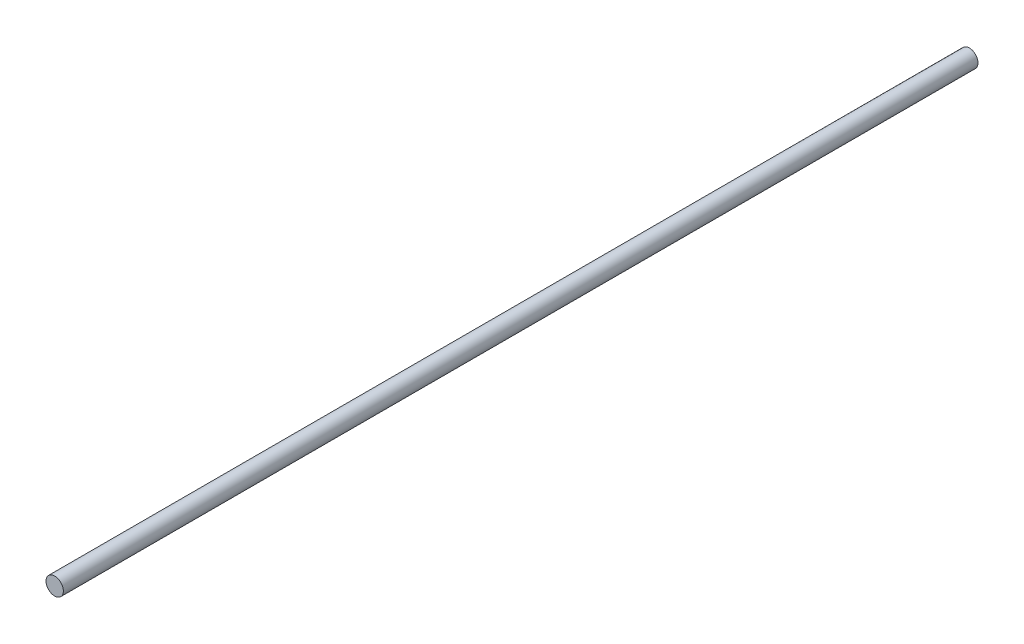
ISO-10303-21;
HEADER;
FILE_DESCRIPTION(('STEP AP214'),'2;1');
FILE_NAME('part.step','',(''),(''),'','','');
FILE_SCHEMA(('AUTOMOTIVE_DESIGN { 1 0 10303 214 1 1 1 1 }'));
ENDSEC;
DATA;
#1=APPLICATION_CONTEXT('core data for automotive mechanical design processes');
#2=APPLICATION_PROTOCOL_DEFINITION('international standard','automotive_design',2000,#1);
#3=PRODUCT_CONTEXT('',#1,'mechanical');
#4=PRODUCT('Part','Part','',(#3));
#5=PRODUCT_RELATED_PRODUCT_CATEGORY('part','',(#4));
#6=PRODUCT_DEFINITION_FORMATION('','',#4);
#7=PRODUCT_DEFINITION_CONTEXT('part definition',#1,'design');
#8=PRODUCT_DEFINITION('design','',#6,#7);
#9=PRODUCT_DEFINITION_SHAPE('','',#8);
#10=(LENGTH_UNIT() NAMED_UNIT(*) SI_UNIT(.MILLI.,.METRE.));
#11=(NAMED_UNIT(*) PLANE_ANGLE_UNIT() SI_UNIT($,.RADIAN.));
#12=(NAMED_UNIT(*) SI_UNIT($,.STERADIAN.) SOLID_ANGLE_UNIT());
#13=UNCERTAINTY_MEASURE_WITH_UNIT(LENGTH_MEASURE(1.E-05),#10,'distance_accuracy_value','');
#14=(GEOMETRIC_REPRESENTATION_CONTEXT(3) GLOBAL_UNCERTAINTY_ASSIGNED_CONTEXT((#13)) GLOBAL_UNIT_ASSIGNED_CONTEXT((#10,
#11,#12)) REPRESENTATION_CONTEXT('',''));
#15=CARTESIAN_POINT('',(0.,0.,0.));
#16=DIRECTION('',(0.,0.,1.));
#17=DIRECTION('',(1.,0.,0.));
#18=AXIS2_PLACEMENT_3D('',#15,#16,#17);
#19=CARTESIAN_POINT('',(0.,0.,250.));
#20=DIRECTION('',(0.,0.,-1.));
#21=DIRECTION('',(-1.,0.,0.));
#22=AXIS2_PLACEMENT_3D('',#19,#20,#21);
#23=CYLINDRICAL_SURFACE('',#22,2.375);
#24=CARTESIAN_POINT('',(0.,0.,250.));
#25=DIRECTION('',(0.,0.,1.));
#26=DIRECTION('',(1.,0.,0.));
#27=AXIS2_PLACEMENT_3D('',#24,#25,#26);
#28=CIRCLE('',#27,2.375);
#29=CARTESIAN_POINT('',(2.375,0.,250.));
#30=VERTEX_POINT('',#29);
#31=EDGE_CURVE('E10',#30,#30,#28,.T.);
#32=ORIENTED_EDGE('',*,*,#31,.F.);
#33=EDGE_LOOP('',(#32));
#34=FACE_BOUND('',#33,.T.);
#35=CARTESIAN_POINT('',(0.,0.,0.));
#36=DIRECTION('',(0.,0.,1.));
#37=DIRECTION('',(1.,0.,0.));
#38=AXIS2_PLACEMENT_3D('',#35,#36,#37);
#39=CIRCLE('',#38,2.375);
#40=CARTESIAN_POINT('',(2.375,0.,0.));
#41=VERTEX_POINT('',#40);
#42=EDGE_CURVE('E36',#41,#41,#39,.T.);
#43=ORIENTED_EDGE('',*,*,#42,.T.);
#44=EDGE_LOOP('',(#43));
#45=FACE_BOUND('',#44,.T.);
#46=ADVANCED_FACE('F33',(#34,#45),#23,.T.);
#47=CARTESIAN_POINT('',(0.,0.,250.));
#48=DIRECTION('',(0.,0.,1.));
#49=DIRECTION('',(1.,0.,0.));
#50=AXIS2_PLACEMENT_3D('',#47,#48,#49);
#51=PLANE('',#50);
#52=ORIENTED_EDGE('',*,*,#31,.T.);
#53=EDGE_LOOP('',(#52));
#54=FACE_BOUND('',#53,.T.);
#55=ADVANCED_FACE('F48',(#54),#51,.T.);
#56=CARTESIAN_POINT('',(0.,0.,0.));
#57=DIRECTION('',(0.,0.,1.));
#58=DIRECTION('',(1.,0.,0.));
#59=AXIS2_PLACEMENT_3D('',#56,#57,#58);
#60=PLANE('',#59);
#61=ORIENTED_EDGE('',*,*,#42,.F.);
#62=EDGE_LOOP('',(#61));
#63=FACE_BOUND('',#62,.T.);
#64=ADVANCED_FACE('F46',(#63),#60,.F.);
#65=CLOSED_SHELL('',(#46,#55,#64));
#66=MANIFOLD_SOLID_BREP('B2',#65);
#67=ADVANCED_BREP_SHAPE_REPRESENTATION('',(#18,#66),#14);
#68=SHAPE_DEFINITION_REPRESENTATION(#9,#67);
ENDSEC;
END-ISO-10303-21;
